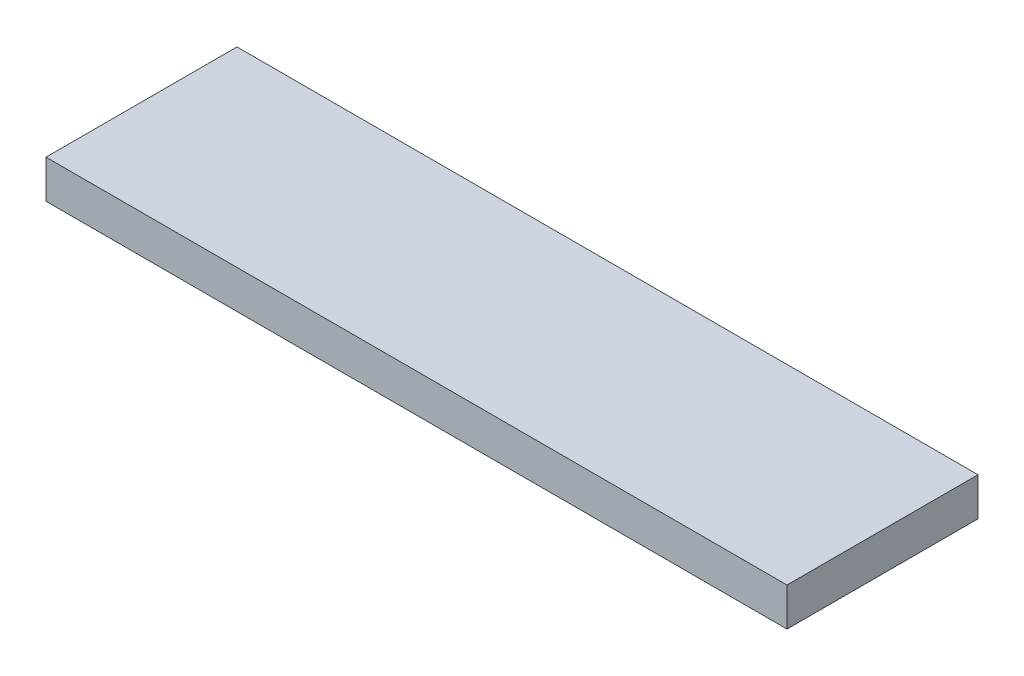
ISO-10303-21;
HEADER;
FILE_DESCRIPTION(('STEP AP214'),'2;1');
FILE_NAME('part.step','',(''),(''),'','','');
FILE_SCHEMA(('AUTOMOTIVE_DESIGN { 1 0 10303 214 1 1 1 1 }'));
ENDSEC;
DATA;
#1=APPLICATION_CONTEXT('core data for automotive mechanical design processes');
#2=APPLICATION_PROTOCOL_DEFINITION('international standard','automotive_design',2000,#1);
#3=PRODUCT_CONTEXT('',#1,'mechanical');
#4=PRODUCT('Part','Part','',(#3));
#5=PRODUCT_RELATED_PRODUCT_CATEGORY('part','',(#4));
#6=PRODUCT_DEFINITION_FORMATION('','',#4);
#7=PRODUCT_DEFINITION_CONTEXT('part definition',#1,'design');
#8=PRODUCT_DEFINITION('design','',#6,#7);
#9=PRODUCT_DEFINITION_SHAPE('','',#8);
#10=(LENGTH_UNIT() NAMED_UNIT(*) SI_UNIT(.MILLI.,.METRE.));
#11=(NAMED_UNIT(*) PLANE_ANGLE_UNIT() SI_UNIT($,.RADIAN.));
#12=(NAMED_UNIT(*) SI_UNIT($,.STERADIAN.) SOLID_ANGLE_UNIT());
#13=UNCERTAINTY_MEASURE_WITH_UNIT(LENGTH_MEASURE(1.E-05),#10,'distance_accuracy_value','');
#14=(GEOMETRIC_REPRESENTATION_CONTEXT(3) GLOBAL_UNCERTAINTY_ASSIGNED_CONTEXT((#13)) GLOBAL_UNIT_ASSIGNED_CONTEXT((#10,
#11,#12)) REPRESENTATION_CONTEXT('',''));
#15=CARTESIAN_POINT('',(0.,0.,0.));
#16=DIRECTION('',(0.,0.,1.));
#17=DIRECTION('',(1.,0.,0.));
#18=AXIS2_PLACEMENT_3D('',#15,#16,#17);
#19=CARTESIAN_POINT('',(0.,10.,0.));
#20=DIRECTION('',(0.,1.,0.));
#21=DIRECTION('',(0.,0.,1.));
#22=AXIS2_PLACEMENT_3D('',#19,#20,#21);
#23=PLANE('',#22);
#24=DIRECTION('',(-1.,0.,0.));
#25=VECTOR('',#24,1.);
#26=CARTESIAN_POINT('',(97.,10.,-25.));
#27=LINE('',#26,#25);
#28=CARTESIAN_POINT('',(-97.,10.,-25.));
#29=VERTEX_POINT('',#28);
#30=CARTESIAN_POINT('',(97.,10.,-25.));
#31=VERTEX_POINT('',#30);
#32=EDGE_CURVE('E68',#29,#31,#27,.F.);
#33=ORIENTED_EDGE('',*,*,#32,.F.);
#34=DIRECTION('',(0.,0.,1.));
#35=VECTOR('',#34,1.);
#36=CARTESIAN_POINT('',(-97.,10.,-25.));
#37=LINE('',#36,#35);
#38=CARTESIAN_POINT('',(-97.,10.,25.));
#39=VERTEX_POINT('',#38);
#40=EDGE_CURVE('E20',#39,#29,#37,.F.);
#41=ORIENTED_EDGE('',*,*,#40,.F.);
#42=DIRECTION('',(1.,0.,0.));
#43=VECTOR('',#42,1.);
#44=CARTESIAN_POINT('',(-97.,10.,25.));
#45=LINE('',#44,#43);
#46=CARTESIAN_POINT('',(97.,10.,25.));
#47=VERTEX_POINT('',#46);
#48=EDGE_CURVE('E58',#47,#39,#45,.F.);
#49=ORIENTED_EDGE('',*,*,#48,.F.);
#50=DIRECTION('',(0.,0.,-1.));
#51=VECTOR('',#50,1.);
#52=CARTESIAN_POINT('',(97.,10.,25.));
#53=LINE('',#52,#51);
#54=EDGE_CURVE('E53',#31,#47,#53,.F.);
#55=ORIENTED_EDGE('',*,*,#54,.F.);
#56=EDGE_LOOP('',(#33,#41,#49,#55));
#57=FACE_BOUND('',#56,.T.);
#58=ADVANCED_FACE('F17',(#57),#23,.T.);
#59=CARTESIAN_POINT('',(-97.,0.,-25.));
#60=DIRECTION('',(-1.,0.,0.));
#61=DIRECTION('',(0.,0.,1.));
#62=AXIS2_PLACEMENT_3D('',#59,#60,#61);
#63=PLANE('',#62);
#64=DIRECTION('',(0.,1.,0.));
#65=VECTOR('',#64,1.);
#66=CARTESIAN_POINT('',(-97.,0.,-25.));
#67=LINE('',#66,#65);
#68=CARTESIAN_POINT('',(-97.,0.,-25.));
#69=VERTEX_POINT('',#68);
#70=EDGE_CURVE('E79',#69,#29,#67,.T.);
#71=ORIENTED_EDGE('',*,*,#70,.F.);
#72=DIRECTION('',(0.,0.,1.));
#73=VECTOR('',#72,1.);
#74=CARTESIAN_POINT('',(-97.,0.,0.));
#75=LINE('',#74,#73);
#76=CARTESIAN_POINT('',(-97.,0.,25.));
#77=VERTEX_POINT('',#76);
#78=EDGE_CURVE('E74',#69,#77,#75,.T.);
#79=ORIENTED_EDGE('',*,*,#78,.T.);
#80=DIRECTION('',(0.,1.,0.));
#81=VECTOR('',#80,1.);
#82=CARTESIAN_POINT('',(-97.,0.,25.));
#83=LINE('',#82,#81);
#84=EDGE_CURVE('E63',#39,#77,#83,.F.);
#85=ORIENTED_EDGE('',*,*,#84,.F.);
#86=ORIENTED_EDGE('',*,*,#40,.T.);
#87=EDGE_LOOP('',(#71,#79,#85,#86));
#88=FACE_BOUND('',#87,.T.);
#89=ADVANCED_FACE('F73',(#88),#63,.T.);
#90=CARTESIAN_POINT('',(-97.,0.,25.));
#91=DIRECTION('',(0.,0.,1.));
#92=DIRECTION('',(1.,0.,0.));
#93=AXIS2_PLACEMENT_3D('',#90,#91,#92);
#94=PLANE('',#93);
#95=ORIENTED_EDGE('',*,*,#84,.T.);
#96=DIRECTION('',(1.,0.,0.));
#97=VECTOR('',#96,1.);
#98=CARTESIAN_POINT('',(0.,0.,25.));
#99=LINE('',#98,#97);
#100=CARTESIAN_POINT('',(97.,0.,25.));
#101=VERTEX_POINT('',#100);
#102=EDGE_CURVE('E84',#77,#101,#99,.T.);
#103=ORIENTED_EDGE('',*,*,#102,.T.);
#104=DIRECTION('',(0.,1.,0.));
#105=VECTOR('',#104,1.);
#106=CARTESIAN_POINT('',(97.,0.,25.));
#107=LINE('',#106,#105);
#108=EDGE_CURVE('E65',#47,#101,#107,.F.);
#109=ORIENTED_EDGE('',*,*,#108,.F.);
#110=ORIENTED_EDGE('',*,*,#48,.T.);
#111=EDGE_LOOP('',(#95,#103,#109,#110));
#112=FACE_BOUND('',#111,.T.);
#113=ADVANCED_FACE('F60',(#112),#94,.T.);
#114=CARTESIAN_POINT('',(97.,0.,25.));
#115=DIRECTION('',(1.,0.,0.));
#116=DIRECTION('',(0.,0.,-1.));
#117=AXIS2_PLACEMENT_3D('',#114,#115,#116);
#118=PLANE('',#117);
#119=ORIENTED_EDGE('',*,*,#108,.T.);
#120=DIRECTION('',(0.,0.,1.));
#121=VECTOR('',#120,1.);
#122=CARTESIAN_POINT('',(97.,0.,0.));
#123=LINE('',#122,#121);
#124=CARTESIAN_POINT('',(97.,0.,-25.));
#125=VERTEX_POINT('',#124);
#126=EDGE_CURVE('E26',#101,#125,#123,.F.);
#127=ORIENTED_EDGE('',*,*,#126,.T.);
#128=DIRECTION('',(0.,1.,0.));
#129=VECTOR('',#128,1.);
#130=CARTESIAN_POINT('',(97.,0.,-25.));
#131=LINE('',#130,#129);
#132=EDGE_CURVE('E34',#31,#125,#131,.F.);
#133=ORIENTED_EDGE('',*,*,#132,.F.);
#134=ORIENTED_EDGE('',*,*,#54,.T.);
#135=EDGE_LOOP('',(#119,#127,#133,#134));
#136=FACE_BOUND('',#135,.T.);
#137=ADVANCED_FACE('F88',(#136),#118,.T.);
#138=CARTESIAN_POINT('',(97.,0.,-25.));
#139=DIRECTION('',(0.,0.,-1.));
#140=DIRECTION('',(-1.,0.,0.));
#141=AXIS2_PLACEMENT_3D('',#138,#139,#140);
#142=PLANE('',#141);
#143=ORIENTED_EDGE('',*,*,#132,.T.);
#144=DIRECTION('',(1.,0.,0.));
#145=VECTOR('',#144,1.);
#146=CARTESIAN_POINT('',(0.,0.,-25.));
#147=LINE('',#146,#145);
#148=EDGE_CURVE('E11',#125,#69,#147,.F.);
#149=ORIENTED_EDGE('',*,*,#148,.T.);
#150=ORIENTED_EDGE('',*,*,#70,.T.);
#151=ORIENTED_EDGE('',*,*,#32,.T.);
#152=EDGE_LOOP('',(#143,#149,#150,#151));
#153=FACE_BOUND('',#152,.T.);
#154=ADVANCED_FACE('F91',(#153),#142,.T.);
#155=CARTESIAN_POINT('',(0.,0.,0.));
#156=DIRECTION('',(0.,1.,0.));
#157=DIRECTION('',(0.,0.,1.));
#158=AXIS2_PLACEMENT_3D('',#155,#156,#157);
#159=PLANE('',#158);
#160=ORIENTED_EDGE('',*,*,#126,.F.);
#161=ORIENTED_EDGE('',*,*,#102,.F.);
#162=ORIENTED_EDGE('',*,*,#78,.F.);
#163=ORIENTED_EDGE('',*,*,#148,.F.);
#164=EDGE_LOOP('',(#160,#161,#162,#163));
#165=FACE_BOUND('',#164,.T.);
#166=ADVANCED_FACE('F90',(#165),#159,.F.);
#167=CLOSED_SHELL('',(#58,#89,#113,#137,#154,#166));
#168=MANIFOLD_SOLID_BREP('B1',#167);
#169=ADVANCED_BREP_SHAPE_REPRESENTATION('',(#18,#168),#14);
#170=SHAPE_DEFINITION_REPRESENTATION(#9,#169);
ENDSEC;
END-ISO-10303-21;
